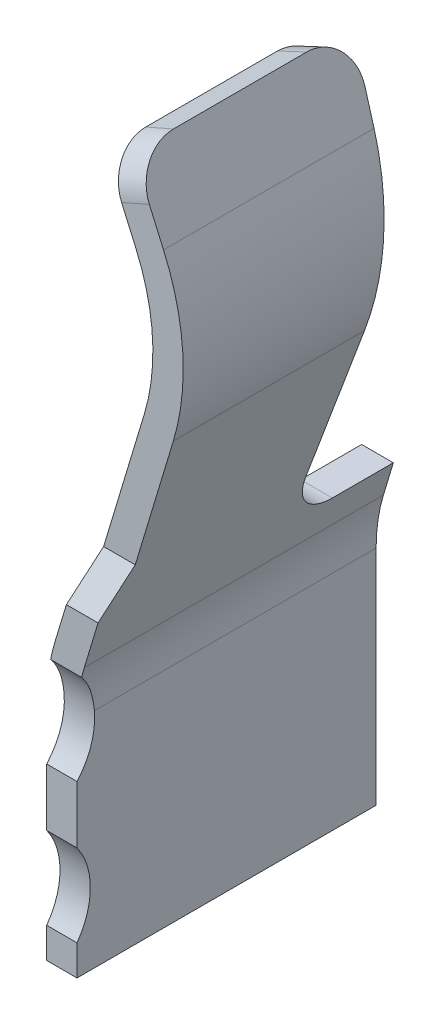
ISO-10303-21;
HEADER;
FILE_DESCRIPTION(('STEP AP214'),'2;1');
FILE_NAME('part.step','',(''),(''),'','','');
FILE_SCHEMA(('AUTOMOTIVE_DESIGN { 1 0 10303 214 1 1 1 1 }'));
ENDSEC;
DATA;
#1=APPLICATION_CONTEXT('core data for automotive mechanical design processes');
#2=APPLICATION_PROTOCOL_DEFINITION('international standard','automotive_design',2000,#1);
#3=PRODUCT_CONTEXT('',#1,'mechanical');
#4=PRODUCT('Part','Part','',(#3));
#5=PRODUCT_RELATED_PRODUCT_CATEGORY('part','',(#4));
#6=PRODUCT_DEFINITION_FORMATION('','',#4);
#7=PRODUCT_DEFINITION_CONTEXT('part definition',#1,'design');
#8=PRODUCT_DEFINITION('design','',#6,#7);
#9=PRODUCT_DEFINITION_SHAPE('','',#8);
#10=(LENGTH_UNIT() NAMED_UNIT(*) SI_UNIT(.MILLI.,.METRE.));
#11=(NAMED_UNIT(*) PLANE_ANGLE_UNIT() SI_UNIT($,.RADIAN.));
#12=(NAMED_UNIT(*) SI_UNIT($,.STERADIAN.) SOLID_ANGLE_UNIT());
#13=UNCERTAINTY_MEASURE_WITH_UNIT(LENGTH_MEASURE(1.E-05),#10,'distance_accuracy_value','');
#14=(GEOMETRIC_REPRESENTATION_CONTEXT(3) GLOBAL_UNCERTAINTY_ASSIGNED_CONTEXT((#13)) GLOBAL_UNIT_ASSIGNED_CONTEXT((#10,
#11,#12)) REPRESENTATION_CONTEXT('',''));
#15=CARTESIAN_POINT('',(0.,0.,0.));
#16=DIRECTION('',(0.,0.,1.));
#17=DIRECTION('',(1.,0.,0.));
#18=AXIS2_PLACEMENT_3D('',#15,#16,#17);
#19=CARTESIAN_POINT('',(3.22386274132999,3.53312166947706,-0.236832722369338));
#20=DIRECTION('',(-0.914255270392898,-0.402239697454473,0.0483789866630426));
#21=DIRECTION('',(0.402711251685503,-0.915327071470027,0.));
#22=AXIS2_PLACEMENT_3D('',#19,#20,#21);
#23=CYLINDRICAL_SURFACE('',#22,0.2);
#24=CARTESIAN_POINT('',(3.21035852267473,3.50329761180303,-0.434687053017797));
#25=CARTESIAN_POINT('',(3.15928159552814,3.6193909515076,-0.448650066039084));
#26=CARTESIAN_POINT('',(3.12101281648182,3.70637250294574,-0.363398989614743));
#27=CARTESIAN_POINT('',(3.12101281648181,3.70637250294574,-0.235652283248446));
#28=(BOUNDED_CURVE() B_SPLINE_CURVE(3,(#24,#25,#26,#27),.UNSPECIFIED.,.F.,
.F.) B_SPLINE_CURVE_WITH_KNOTS((4,4),(3.0320715031167,4.71238898038462),
.UNSPECIFIED.) CURVE() GEOMETRIC_REPRESENTATION_ITEM() RATIONAL_B_SPLINE_CURVE((1.,
0.778229742533871,0.778229742533871,1.)) REPRESENTATION_ITEM(''));
#29=CARTESIAN_POINT('',(3.21035852267473,3.50329761180303,-0.434687053017797));
#30=VERTEX_POINT('',#29);
#31=CARTESIAN_POINT('',(3.12101281648181,3.70637250294574,-0.235652283248446));
#32=VERTEX_POINT('',#31);
#33=EDGE_CURVE('E468',#30,#32,#28,.T.);
#34=ORIENTED_EDGE('',*,*,#33,.F.);
#35=DIRECTION('',(0.914255270392898,0.402239697454473,-0.0483789866630426));
#36=VECTOR('',#35,1.);
#37=CARTESIAN_POINT('',(-20.837177596038,-7.07676024092296,0.837819069551529));
#38=LINE('',#37,#36);
#39=CARTESIAN_POINT('',(3.07305946195422,3.44289092405021,-0.427421697659669));
#40=VERTEX_POINT('',#39);
#41=EDGE_CURVE('E11',#40,#30,#38,.T.);
#42=ORIENTED_EDGE('',*,*,#41,.F.);
#43=CARTESIAN_POINT('',(2.98371375576131,3.64596581519291,-0.228386927890318));
#44=CARTESIAN_POINT('',(2.98371375576131,3.64596581519291,-0.356133634256616));
#45=CARTESIAN_POINT('',(3.02198253480764,3.55898426375477,-0.441384710680957));
#46=CARTESIAN_POINT('',(3.07305946195422,3.44289092405021,-0.427421697659669));
#47=(BOUNDED_CURVE() B_SPLINE_CURVE(3,(#43,#44,#45,#46),.UNSPECIFIED.,.F.,
.F.) B_SPLINE_CURVE_WITH_KNOTS((4,4),(1.57079632679495,3.25111380406287),
.UNSPECIFIED.) CURVE() GEOMETRIC_REPRESENTATION_ITEM() RATIONAL_B_SPLINE_CURVE((1.,
0.778229742533869,0.778229742533869,1.)) REPRESENTATION_ITEM(''));
#48=CARTESIAN_POINT('',(2.98371375576131,3.64596581519291,-0.228386927890318));
#49=VERTEX_POINT('',#48);
#50=EDGE_CURVE('E162',#49,#40,#47,.T.);
#51=ORIENTED_EDGE('',*,*,#50,.F.);
#52=DIRECTION('',(-0.914255270392898,-0.402239697454473,0.0483789866630426));
#53=VECTOR('',#52,1.);
#54=CARTESIAN_POINT('',(3.14332049099289,3.71618708377106,-0.236832722369339));
#55=LINE('',#54,#53);
#56=EDGE_CURVE('E508',#32,#49,#55,.T.);
#57=ORIENTED_EDGE('',*,*,#56,.F.);
#58=EDGE_LOOP('',(#34,#42,#51,#57));
#59=FACE_BOUND('',#58,.T.);
#60=ADVANCED_FACE('F16',(#59),#23,.T.);
#61=CARTESIAN_POINT('',(3.20155506681891,3.52330708865174,0.423604352914838));
#62=DIRECTION('',(0.915327071470027,0.402711251685503,0.));
#63=DIRECTION('',(-0.402711251685503,0.915327071470027,0.));
#64=AXIS2_PLACEMENT_3D('',#61,#62,#63);
#65=CYLINDRICAL_SURFACE('',#64,0.2);
#66=CARTESIAN_POINT('',(3.06425600609841,3.46290040089891,0.423604352914837));
#67=DIRECTION('',(-0.915327071470027,-0.402711251685502,0.));
#68=DIRECTION('',(-0.402711251685502,0.915327071470027,0.));
#69=AXIS2_PLACEMENT_3D('',#66,#67,#68);
#70=CIRCLE('',#69,0.2);
#71=CARTESIAN_POINT('',(3.06425600609841,3.46290040089891,0.623604352914837));
#72=VERTEX_POINT('',#71);
#73=CARTESIAN_POINT('',(2.98371375576131,3.64596581519291,0.423604352914837));
#74=VERTEX_POINT('',#73);
#75=EDGE_CURVE('E175',#72,#74,#70,.T.);
#76=ORIENTED_EDGE('',*,*,#75,.F.);
#77=DIRECTION('',(-0.915327071470027,-0.402711251685503,0.));
#78=VECTOR('',#77,1.);
#79=CARTESIAN_POINT('',(-21.5530633966531,-7.36784176638169,0.623604352914803));
#80=LINE('',#79,#78);
#81=CARTESIAN_POINT('',(3.20155506681891,3.52330708865174,0.623604352914837));
#82=VERTEX_POINT('',#81);
#83=EDGE_CURVE('E27',#82,#72,#80,.T.);
#84=ORIENTED_EDGE('',*,*,#83,.F.);
#85=CARTESIAN_POINT('',(3.20155506681891,3.52330708865174,0.423604352914838));
#86=DIRECTION('',(0.915327071470028,0.4027112516855,0.));
#87=DIRECTION('',(0.4027112516855,-0.915327071470028,0.));
#88=AXIS2_PLACEMENT_3D('',#85,#86,#87);
#89=CIRCLE('',#88,0.2);
#90=CARTESIAN_POINT('',(3.12101281648181,3.70637250294574,0.423604352914837));
#91=VERTEX_POINT('',#90);
#92=EDGE_CURVE('E531',#91,#82,#89,.T.);
#93=ORIENTED_EDGE('',*,*,#92,.F.);
#94=DIRECTION('',(0.915327071470027,0.402711251685503,0.));
#95=VECTOR('',#94,1.);
#96=CARTESIAN_POINT('',(3.12101281648181,3.70637250294574,0.423604352914837));
#97=LINE('',#96,#95);
#98=EDGE_CURVE('E467',#74,#91,#97,.T.);
#99=ORIENTED_EDGE('',*,*,#98,.F.);
#100=EDGE_LOOP('',(#76,#84,#93,#99));
#101=FACE_BOUND('',#100,.T.);
#102=ADVANCED_FACE('F751',(#101),#65,.T.);
#103=CARTESIAN_POINT('',(-25.65,1.65634067151207,-0.212546111318104));
#104=DIRECTION('',(0.,-1.,0.));
#105=DIRECTION('',(0.,0.,-1.));
#106=AXIS2_PLACEMENT_3D('',#103,#104,#105);
#107=PLANE('',#106);
#108=DIRECTION('',(0.,0.,-1.));
#109=VECTOR('',#108,1.);
#110=CARTESIAN_POINT('',(2.88849659089442,1.65634067151207,-0.740000000000021));
#111=LINE('',#110,#109);
#112=CARTESIAN_POINT('',(2.88849659089442,1.65634067151207,-0.438042305987955));
#113=VERTEX_POINT('',#112);
#114=CARTESIAN_POINT('',(2.88849659089442,1.65634067151207,-0.740000000000021));
#115=VERTEX_POINT('',#114);
#116=EDGE_CURVE('E255',#113,#115,#111,.T.);
#117=ORIENTED_EDGE('',*,*,#116,.F.);
#118=DIRECTION('',(1.,0.,0.));
#119=VECTOR('',#118,1.);
#120=CARTESIAN_POINT('',(3.04516492105845,1.65634067151207,-0.438042305987954));
#121=LINE('',#120,#119);
#122=CARTESIAN_POINT('',(3.04516492105846,1.65634067151207,-0.438042305987954));
#123=VERTEX_POINT('',#122);
#124=EDGE_CURVE('E455',#113,#123,#121,.T.);
#125=ORIENTED_EDGE('',*,*,#124,.T.);
#126=DIRECTION('',(0.,0.,1.));
#127=VECTOR('',#126,1.);
#128=CARTESIAN_POINT('',(3.04516492105846,1.65634067151207,-0.74000000000002));
#129=LINE('',#128,#127);
#130=CARTESIAN_POINT('',(3.04516492105846,1.65634067151207,-0.74000000000002));
#131=VERTEX_POINT('',#130);
#132=EDGE_CURVE('E476',#131,#123,#129,.T.);
#133=ORIENTED_EDGE('',*,*,#132,.F.);
#134=DIRECTION('',(-1.,0.,0.));
#135=VECTOR('',#134,1.);
#136=CARTESIAN_POINT('',(3.81,1.65634067151207,-0.740000000000019));
#137=LINE('',#136,#135);
#138=EDGE_CURVE('E496',#131,#115,#137,.T.);
#139=ORIENTED_EDGE('',*,*,#138,.T.);
#140=EDGE_LOOP('',(#117,#125,#133,#139));
#141=FACE_BOUND('',#140,.T.);
#142=ADVANCED_FACE('F314',(#141),#107,.F.);
#143=CARTESIAN_POINT('',(-25.65,3.70637250294571,-0.459111687165995));
#144=DIRECTION('',(0.,0.119413416546905,0.992844618230162));
#145=DIRECTION('',(1.,0.,0.));
#146=AXIS2_PLACEMENT_3D('',#143,#144,#145);
#147=PLANE('',#146);
#148=DIRECTION('',(0.286748539926818,0.951150986717315,-0.11439875574724));
#149=VECTOR('',#148,1.);
#150=CARTESIAN_POINT('',(3.01412236488806,1.55337185451571,-0.200161637444148));
#151=LINE('',#150,#149);
#152=CARTESIAN_POINT('',(3.11266002273041,1.88022335482146,-0.239473382341922));
#153=VERTEX_POINT('',#152);
#154=CARTESIAN_POINT('',(3.32020176045379,2.56864369924933,-0.322272466749581));
#155=VERTEX_POINT('',#154);
#156=EDGE_CURVE('E482',#153,#155,#151,.T.);
#157=ORIENTED_EDGE('',*,*,#156,.F.);
#158=DIRECTION('',(-1.,0.,0.));
#159=VECTOR('',#158,1.);
#160=CARTESIAN_POINT('',(2.88849659089441,1.88022335482146,-0.239473382341922));
#161=LINE('',#160,#159);
#162=CARTESIAN_POINT('',(2.95599169256637,1.88022335482146,-0.239473382341922));
#163=VERTEX_POINT('',#162);
#164=EDGE_CURVE('E380',#153,#163,#161,.T.);
#165=ORIENTED_EDGE('',*,*,#164,.T.);
#166=DIRECTION('',(-0.28674853992682,-0.951150986717314,0.11439875574724));
#167=VECTOR('',#166,1.);
#168=CARTESIAN_POINT('',(2.87033604511149,1.59610175610151,-0.205300934614505));
#169=LINE('',#168,#167);
#170=CARTESIAN_POINT('',(3.17658626409634,2.61194022573825,-0.327479914176623));
#171=VERTEX_POINT('',#170);
#172=EDGE_CURVE('E253',#171,#163,#169,.T.);
#173=ORIENTED_EDGE('',*,*,#172,.F.);
#174=CARTESIAN_POINT('',(3.13447669318341,3.30329498734983,-0.410631932744419));
#175=CARTESIAN_POINT('',(3.2314549897076,3.08287189317973,-0.384120760424612));
#176=CARTESIAN_POINT('',(3.24609551117657,2.84250387207174,-0.355210731501567));
#177=CARTESIAN_POINT('',(3.17658626409634,2.61194022573825,-0.327479914176623));
#178=(BOUNDED_CURVE() B_SPLINE_CURVE(3,(#174,#175,#176,#177),.UNSPECIFIED.,.F.,
.F.) B_SPLINE_CURVE_WITH_KNOTS((4,4),(4.29791199977039,5.00519872138853),
.UNSPECIFIED.) CURVE() GEOMETRIC_REPRESENTATION_ITEM() RATIONAL_B_SPLINE_CURVE((1.,
0.958744787021091,0.958744787021091,1.)) REPRESENTATION_ITEM(''));
#179=CARTESIAN_POINT('',(3.13447669318341,3.30329498734983,-0.410631932744419));
#180=VERTEX_POINT('',#179);
#181=EDGE_CURVE('E504',#180,#171,#178,.T.);
#182=ORIENTED_EDGE('',*,*,#181,.F.);
#183=DIRECTION('',(0.400292818236851,-0.909830186054405,0.109428936813833));
#184=VECTOR('',#183,1.);
#185=CARTESIAN_POINT('',(3.12004918034407,3.33608744850051,-0.414576013974334));
#186=LINE('',#185,#184);
#187=EDGE_CURVE('E251',#40,#180,#186,.T.);
#188=ORIENTED_EDGE('',*,*,#187,.F.);
#189=ORIENTED_EDGE('',*,*,#41,.T.);
#190=DIRECTION('',(-0.40029281823685,0.909830186054405,-0.109428936813833));
#191=VECTOR('',#190,1.);
#192=CARTESIAN_POINT('',(3.25766648991178,3.39577078475993,-0.421754368938235));
#193=LINE('',#192,#191);
#194=CARTESIAN_POINT('',(3.27177575390391,3.36370167510267,-0.417897288102547));
#195=VERTEX_POINT('',#194);
#196=EDGE_CURVE('E514',#195,#30,#193,.T.);
#197=ORIENTED_EDGE('',*,*,#196,.F.);
#198=CARTESIAN_POINT('',(3.32020176045379,2.56864369924933,-0.322272466749581));
#199=CARTESIAN_POINT('',(3.40013739459604,2.83379189253285,-0.354162906673267));
#200=CARTESIAN_POINT('',(3.38330079490673,3.11021511680704,-0.387409439934769));
#201=CARTESIAN_POINT('',(3.27177575390391,3.36370167510267,-0.417897288102547));
#202=(BOUNDED_CURVE() B_SPLINE_CURVE(3,(#198,#199,#200,#201),.UNSPECIFIED.,.F.,
.F.) B_SPLINE_CURVE_WITH_KNOTS((4,4),(1.27798658579106,1.98527330740919),
.UNSPECIFIED.) CURVE() GEOMETRIC_REPRESENTATION_ITEM() RATIONAL_B_SPLINE_CURVE((1.,
0.958744787021091,0.958744787021091,1.)) REPRESENTATION_ITEM(''));
#203=EDGE_CURVE('E493',#155,#195,#202,.T.);
#204=ORIENTED_EDGE('',*,*,#203,.F.);
#205=EDGE_LOOP('',(#157,#165,#173,#182,#188,#189,#197,#204));
#206=FACE_BOUND('',#205,.T.);
#207=ADVANCED_FACE('F310',(#206),#147,.F.);
#208=CARTESIAN_POINT('',(-25.65,1.94413292378283,0.623604352914797));
#209=DIRECTION('',(0.,0.,-1.));
#210=DIRECTION('',(0.,-1.,0.));
#211=AXIS2_PLACEMENT_3D('',#208,#209,#210);
#212=PLANE('',#211);
#213=DIRECTION('',(0.4027112516855,-0.915327071470028,0.));
#214=VECTOR('',#213,1.);
#215=CARTESIAN_POINT('',(3.27177575390391,3.36370167510267,0.623604352914838));
#216=LINE('',#215,#214);
#217=CARTESIAN_POINT('',(3.27177575390391,3.36370167510267,0.623604352914838));
#218=VERTEX_POINT('',#217);
#219=EDGE_CURVE('E524',#82,#218,#216,.T.);
#220=ORIENTED_EDGE('',*,*,#219,.F.);
#221=ORIENTED_EDGE('',*,*,#83,.T.);
#222=DIRECTION('',(-0.402711251685501,0.915327071470028,0.));
#223=VECTOR('',#222,1.);
#224=CARTESIAN_POINT('',(3.13447669318341,3.30329498734984,0.623604352914837));
#225=LINE('',#224,#223);
#226=CARTESIAN_POINT('',(3.13447669318341,3.30329498734983,0.623604352914837));
#227=VERTEX_POINT('',#226);
#228=EDGE_CURVE('E505',#227,#72,#225,.T.);
#229=ORIENTED_EDGE('',*,*,#228,.F.);
#230=CARTESIAN_POINT('',(2.21914962171339,2.90058373566433,0.623604352914836));
#231=DIRECTION('',(0.,0.,1.));
#232=DIRECTION('',(-1.,0.,0.));
#233=AXIS2_PLACEMENT_3D('',#230,#231,#232);
#234=CIRCLE('',#233,1.);
#235=CARTESIAN_POINT('',(3.17658626409634,2.61194022573825,0.623604352914837));
#236=VERTEX_POINT('',#235);
#237=EDGE_CURVE('E256',#236,#227,#234,.T.);
#238=ORIENTED_EDGE('',*,*,#237,.F.);
#239=DIRECTION('',(0.28864350992609,0.957436642382956,0.));
#240=VECTOR('',#239,1.);
#241=CARTESIAN_POINT('',(2.85256335761704,1.53714937485737,0.623604352914836));
#242=LINE('',#241,#240);
#243=CARTESIAN_POINT('',(2.97525884977164,1.94413292378283,0.623604352914837));
#244=VERTEX_POINT('',#243);
#245=EDGE_CURVE('E259',#244,#236,#242,.T.);
#246=ORIENTED_EDGE('',*,*,#245,.F.);
#247=DIRECTION('',(1.,0.,0.));
#248=VECTOR('',#247,1.);
#249=CARTESIAN_POINT('',(-25.65,1.94413292378283,0.623604352914797));
#250=LINE('',#249,#248);
#251=CARTESIAN_POINT('',(3.13192717993567,1.94413292378283,0.623604352914837));
#252=VERTEX_POINT('',#251);
#253=EDGE_CURVE('E499',#244,#252,#250,.T.);
#254=ORIENTED_EDGE('',*,*,#253,.T.);
#255=DIRECTION('',(-0.288643509926088,-0.957436642382956,0.));
#256=VECTOR('',#255,1.);
#257=CARTESIAN_POINT('',(2.99617885397448,1.49385284836845,0.623604352914837));
#258=LINE('',#257,#256);
#259=CARTESIAN_POINT('',(3.32020176045378,2.56864369924933,0.623604352914837));
#260=VERTEX_POINT('',#259);
#261=EDGE_CURVE('E484',#260,#252,#258,.T.);
#262=ORIENTED_EDGE('',*,*,#261,.F.);
#263=CARTESIAN_POINT('',(2.21914962171339,2.90058373566433,0.623604352914836));
#264=DIRECTION('',(0.,0.,-1.));
#265=DIRECTION('',(-1.,0.,0.));
#266=AXIS2_PLACEMENT_3D('',#263,#264,#265);
#267=CIRCLE('',#266,1.15);
#268=EDGE_CURVE('E617',#218,#260,#267,.T.);
#269=ORIENTED_EDGE('',*,*,#268,.F.);
#270=EDGE_LOOP('',(#220,#221,#229,#238,#246,#254,#262,#269));
#271=FACE_BOUND('',#270,.T.);
#272=ADVANCED_FACE('F313',(#271),#212,.F.);
#273=CARTESIAN_POINT('',(-25.65,1.7003498353216,0.749999999999972));
#274=DIRECTION('',(0.,-0.460287319631494,-0.887770005906065));
#275=DIRECTION('',(0.,-0.887770005906065,0.460287319631494));
#276=AXIS2_PLACEMENT_3D('',#273,#274,#275);
#277=PLANE('',#276);
#278=ORIENTED_EDGE('',*,*,#253,.F.);
#279=DIRECTION('',(0.258541028225373,0.857586072334425,-0.444637678635293));
#280=VECTOR('',#279,1.);
#281=CARTESIAN_POINT('',(3.03357656169357,2.13757401070795,0.523309818502746));
#282=LINE('',#281,#280);
#283=CARTESIAN_POINT('',(2.90757891232073,1.7196371362757,0.73999999999998));
#284=VERTEX_POINT('',#283);
#285=EDGE_CURVE('E95',#284,#244,#282,.T.);
#286=ORIENTED_EDGE('',*,*,#285,.F.);
#287=DIRECTION('',(-1.,0.,0.));
#288=VECTOR('',#287,1.);
#289=CARTESIAN_POINT('',(3.81,1.7196371362757,0.739999999999981));
#290=LINE('',#289,#288);
#291=CARTESIAN_POINT('',(3.06424724248477,1.7196371362757,0.73999999999998));
#292=VERTEX_POINT('',#291);
#293=EDGE_CURVE('E589',#292,#284,#290,.T.);
#294=ORIENTED_EDGE('',*,*,#293,.F.);
#295=DIRECTION('',(-0.258541028225372,-0.857586072334425,0.444637678635293));
#296=VECTOR('',#295,1.);
#297=CARTESIAN_POINT('',(3.17977263808379,2.10283732290249,0.541319952677682));
#298=LINE('',#297,#296);
#299=EDGE_CURVE('E83',#252,#292,#298,.T.);
#300=ORIENTED_EDGE('',*,*,#299,.F.);
#301=EDGE_LOOP('',(#278,#286,#294,#300));
#302=FACE_BOUND('',#301,.T.);
#303=ADVANCED_FACE('F327',(#302),#277,.F.);
#304=CARTESIAN_POINT('',(3.81,1.24850586493128,0.739999999999981));
#305=DIRECTION('',(0.,0.,-1.));
#306=DIRECTION('',(0.,-1.,0.));
#307=AXIS2_PLACEMENT_3D('',#304,#305,#306);
#308=PLANE('',#307);
#309=DIRECTION('',(0.,1.,0.));
#310=VECTOR('',#309,1.);
#311=CARTESIAN_POINT('',(2.96,0.145965815192914,0.73999999999998));
#312=LINE('',#311,#310);
#313=CARTESIAN_POINT('',(2.96,0.145965815192914,0.73999999999998));
#314=VERTEX_POINT('',#313);
#315=CARTESIAN_POINT('',(2.96,0.296740599868486,0.73999999999998));
#316=VERTEX_POINT('',#315);
#317=EDGE_CURVE('E421',#314,#316,#312,.T.);
#318=ORIENTED_EDGE('',*,*,#317,.T.);
#319=DIRECTION('',(-1.,0.,0.));
#320=VECTOR('',#319,1.);
#321=CARTESIAN_POINT('',(-25.65,0.296740599868486,0.73999999999994));
#322=LINE('',#321,#320);
#323=CARTESIAN_POINT('',(2.81,0.296740599868486,0.739999999999979));
#324=VERTEX_POINT('',#323);
#325=EDGE_CURVE('E237',#316,#324,#322,.T.);
#326=ORIENTED_EDGE('',*,*,#325,.T.);
#327=DIRECTION('',(0.,-1.,0.));
#328=VECTOR('',#327,1.);
#329=CARTESIAN_POINT('',(2.81,0.145965815192914,0.739999999999979));
#330=LINE('',#329,#328);
#331=CARTESIAN_POINT('',(2.81,0.145965815192914,0.739999999999979));
#332=VERTEX_POINT('',#331);
#333=EDGE_CURVE('E234',#324,#332,#330,.T.);
#334=ORIENTED_EDGE('',*,*,#333,.T.);
#335=DIRECTION('',(1.,0.,0.));
#336=VECTOR('',#335,1.);
#337=CARTESIAN_POINT('',(2.96,0.145965815192914,0.73999999999998));
#338=LINE('',#337,#336);
#339=EDGE_CURVE('E219',#332,#314,#338,.T.);
#340=ORIENTED_EDGE('',*,*,#339,.T.);
#341=EDGE_LOOP('',(#318,#326,#334,#340));
#342=FACE_BOUND('',#341,.T.);
#343=ADVANCED_FACE('F770',(#342),#308,.F.);
#344=CARTESIAN_POINT('',(3.81,1.24850586493128,-0.740000000000019));
#345=DIRECTION('',(0.,0.,-1.));
#346=DIRECTION('',(0.,-1.,0.));
#347=AXIS2_PLACEMENT_3D('',#344,#345,#346);
#348=PLANE('',#347);
#349=ORIENTED_EDGE('',*,*,#138,.F.);
#350=DIRECTION('',(0.288643509926088,0.957436642382956,0.));
#351=VECTOR('',#350,1.);
#352=CARTESIAN_POINT('',(2.99617885397448,1.49385284836845,-0.74000000000002));
#353=LINE('',#352,#351);
#354=CARTESIAN_POINT('',(2.99617885397448,1.49385284836845,-0.74000000000002));
#355=VERTEX_POINT('',#354);
#356=EDGE_CURVE('E483',#355,#131,#353,.T.);
#357=ORIENTED_EDGE('',*,*,#356,.F.);
#358=CARTESIAN_POINT('',(3.81,1.24850586493128,-0.740000000000019));
#359=DIRECTION('',(0.,0.,-1.));
#360=DIRECTION('',(1.,0.,0.));
#361=AXIS2_PLACEMENT_3D('',#358,#359,#360);
#362=CIRCLE('',#361,0.85);
#363=CARTESIAN_POINT('',(2.96,1.24850586493128,-0.74000000000002));
#364=VERTEX_POINT('',#363);
#365=EDGE_CURVE('E449',#364,#355,#362,.T.);
#366=ORIENTED_EDGE('',*,*,#365,.F.);
#367=DIRECTION('',(0.,1.,0.));
#368=VECTOR('',#367,1.);
#369=CARTESIAN_POINT('',(2.96,0.145965815192914,-0.74000000000002));
#370=LINE('',#369,#368);
#371=CARTESIAN_POINT('',(2.96,0.145965815192914,-0.74000000000002));
#372=VERTEX_POINT('',#371);
#373=EDGE_CURVE('E430',#372,#364,#370,.T.);
#374=ORIENTED_EDGE('',*,*,#373,.F.);
#375=DIRECTION('',(1.,0.,0.));
#376=VECTOR('',#375,1.);
#377=CARTESIAN_POINT('',(2.96,0.145965815192914,-0.74000000000002));
#378=LINE('',#377,#376);
#379=CARTESIAN_POINT('',(2.81,0.145965815192914,-0.740000000000021));
#380=VERTEX_POINT('',#379);
#381=EDGE_CURVE('E434',#380,#372,#378,.T.);
#382=ORIENTED_EDGE('',*,*,#381,.F.);
#383=DIRECTION('',(0.,-1.,0.));
#384=VECTOR('',#383,1.);
#385=CARTESIAN_POINT('',(2.81,0.145965815192914,-0.740000000000021));
#386=LINE('',#385,#384);
#387=CARTESIAN_POINT('',(2.81,1.24850586493128,-0.740000000000021));
#388=VERTEX_POINT('',#387);
#389=EDGE_CURVE('E42',#388,#380,#386,.T.);
#390=ORIENTED_EDGE('',*,*,#389,.F.);
#391=CARTESIAN_POINT('',(3.81,1.24850586493128,-0.740000000000019));
#392=DIRECTION('',(0.,0.,1.));
#393=DIRECTION('',(1.,0.,0.));
#394=AXIS2_PLACEMENT_3D('',#391,#392,#393);
#395=CIRCLE('',#394,1.);
#396=CARTESIAN_POINT('',(2.85256335761705,1.53714937485737,-0.740000000000021));
#397=VERTEX_POINT('',#396);
#398=EDGE_CURVE('E374',#397,#388,#395,.T.);
#399=ORIENTED_EDGE('',*,*,#398,.F.);
#400=DIRECTION('',(-0.28864350992609,-0.957436642382956,0.));
#401=VECTOR('',#400,1.);
#402=CARTESIAN_POINT('',(2.85256335761705,1.53714937485737,-0.740000000000021));
#403=LINE('',#402,#401);
#404=EDGE_CURVE('E462',#115,#397,#403,.T.);
#405=ORIENTED_EDGE('',*,*,#404,.F.);
#406=EDGE_LOOP('',(#349,#357,#366,#374,#382,#390,#399,#405));
#407=FACE_BOUND('',#406,.T.);
#408=ADVANCED_FACE('F309',(#407),#348,.T.);
#409=CARTESIAN_POINT('',(2.81,0.145965815192914,-0.740000000000021));
#410=DIRECTION('',(1.,0.,0.));
#411=DIRECTION('',(0.,1.,0.));
#412=AXIS2_PLACEMENT_3D('',#409,#410,#411);
#413=PLANE('',#412);
#414=DIRECTION('',(0.,-1.,0.));
#415=VECTOR('',#414,1.);
#416=CARTESIAN_POINT('',(2.81,0.145965815192914,0.739999999999979));
#417=LINE('',#416,#415);
#418=CARTESIAN_POINT('',(2.81,0.988055123608201,0.739999999999979));
#419=VERTEX_POINT('',#418);
#420=CARTESIAN_POINT('',(2.81,0.703259400131467,0.739999999999979));
#421=VERTEX_POINT('',#420);
#422=EDGE_CURVE('E206',#419,#421,#417,.T.);
#423=ORIENTED_EDGE('',*,*,#422,.F.);
#424=CARTESIAN_POINT('',(2.81,1.21669179396546,0.995153761033096));
#425=DIRECTION('',(1.,0.,0.));
#426=DIRECTION('',(0.,1.,0.));
#427=AXIS2_PLACEMENT_3D('',#424,#425,#426);
#428=CIRCLE('',#427,0.342604974863759);
#429=CARTESIAN_POINT('',(2.81,1.24850586493128,0.654029100989324));
#430=VERTEX_POINT('',#429);
#431=EDGE_CURVE('E377',#419,#430,#428,.T.);
#432=ORIENTED_EDGE('',*,*,#431,.T.);
#433=DIRECTION('',(0.,0.,1.));
#434=VECTOR('',#433,1.);
#435=CARTESIAN_POINT('',(2.81,1.24850586493128,-0.740000000000021));
#436=LINE('',#435,#434);
#437=EDGE_CURVE('E366',#388,#430,#436,.T.);
#438=ORIENTED_EDGE('',*,*,#437,.F.);
#439=ORIENTED_EDGE('',*,*,#389,.T.);
#440=DIRECTION('',(0.,0.,1.));
#441=VECTOR('',#440,1.);
#442=CARTESIAN_POINT('',(2.81,0.145965815192914,-0.740000000000021));
#443=LINE('',#442,#441);
#444=EDGE_CURVE('E445',#380,#332,#443,.T.);
#445=ORIENTED_EDGE('',*,*,#444,.T.);
#446=ORIENTED_EDGE('',*,*,#333,.F.);
#447=CARTESIAN_POINT('',(2.81,0.499999999999977,1.0194268345702));
#448=DIRECTION('',(1.,0.,0.));
#449=DIRECTION('',(0.,1.,0.));
#450=AXIS2_PLACEMENT_3D('',#447,#448,#449);
#451=CIRCLE('',#450,0.345533991988848);
#452=EDGE_CURVE('E226',#324,#421,#451,.T.);
#453=ORIENTED_EDGE('',*,*,#452,.T.);
#454=EDGE_LOOP('',(#423,#432,#438,#439,#445,#446,#453));
#455=FACE_BOUND('',#454,.T.);
#456=ADVANCED_FACE('F232',(#455),#413,.F.);
#457=CARTESIAN_POINT('',(3.81,1.24850586493128,-0.740000000000019));
#458=DIRECTION('',(0.,0.,1.));
#459=DIRECTION('',(-1.,0.,0.));
#460=AXIS2_PLACEMENT_3D('',#457,#458,#459);
#461=CYLINDRICAL_SURFACE('',#460,1.);
#462=ORIENTED_EDGE('',*,*,#437,.T.);
#463=CARTESIAN_POINT('',(2.81,1.24850586493127,0.654029100989324));
#464=CARTESIAN_POINT('',(2.80999992592637,1.25306932177748,0.654454497923835));
#465=CARTESIAN_POINT('',(2.81003123527863,1.25762446546712,0.654969794425774));
#466=CARTESIAN_POINT('',(2.81015516509568,1.26669234380872,0.656178662703507));
#467=CARTESIAN_POINT('',(2.81024754920297,1.27120517419842,0.656871540938563));
#468=CARTESIAN_POINT('',(2.81049191329322,1.28018764830056,0.658435530000101));
#469=CARTESIAN_POINT('',(2.81064375710387,1.28465736694881,0.659306231418194));
#470=CARTESIAN_POINT('',(2.81100522296896,1.29355289226453,0.661225514697385));
#471=CARTESIAN_POINT('',(2.81121480554091,1.29797872680563,0.66227397481712));
#472=CARTESIAN_POINT('',(2.81168997207293,1.30678583476397,0.664548502475786));
#473=CARTESIAN_POINT('',(2.81195560747397,1.31116706334694,0.665774732832754));
#474=CARTESIAN_POINT('',(2.81254110847119,1.31988437499395,0.668404514864849));
#475=CARTESIAN_POINT('',(2.81286110900543,1.32422031651338,0.669808505488944));
#476=CARTESIAN_POINT('',(2.81355358930377,1.33284654509273,0.672793524574298));
#477=CARTESIAN_POINT('',(2.81392627862693,1.33713657245114,0.67437525453736));
#478=CARTESIAN_POINT('',(2.81472239758146,1.34567049059148,0.677715533217567));
#479=CARTESIAN_POINT('',(2.81514610132699,1.34991398511754,0.679475028174295));
#480=CARTESIAN_POINT('',(2.81603678150611,1.35830019523904,0.683146652073494));
#481=CARTESIAN_POINT('',(2.81650349280442,1.36244335249443,0.685057836907499));
#482=CARTESIAN_POINT('',(2.81747687139799,1.37063194178074,0.6890335315101));
#483=CARTESIAN_POINT('',(2.81798338788338,1.3746776733665,0.691097460992356));
#484=CARTESIAN_POINT('',(2.81903286831764,1.38267128376232,0.695378434355305));
#485=CARTESIAN_POINT('',(2.81957575264737,1.3866193519919,0.69759514404689));
#486=CARTESIAN_POINT('',(2.82069455701777,1.39441764648526,0.702181418874191));
#487=CARTESIAN_POINT('',(2.82127045700561,1.39826793013232,0.704550891332612));
#488=CARTESIAN_POINT('',(2.82245197037195,1.40587073759695,0.709442454924467));
#489=CARTESIAN_POINT('',(2.82305761081716,1.40962316741917,0.711964685588729));
#490=CARTESIAN_POINT('',(2.82429537926365,1.4170304504751,0.717161525963165));
#491=CARTESIAN_POINT('',(2.82492756852699,1.42068504210779,0.719836493879691));
#492=CARTESIAN_POINT('',(2.82621529345779,1.42789683764576,0.725338623347788));
#493=CARTESIAN_POINT('',(2.82687091152925,1.43145359950846,0.728166344681211));
#494=CARTESIAN_POINT('',(2.82820248405423,1.43847023752972,0.733973670299352));
#495=CARTESIAN_POINT('',(2.82887852949904,1.44192948379825,0.736954014976151));
#496=CARTESIAN_POINT('',(2.82956088186527,1.44532846432271,0.73999999999998));
#497=B_SPLINE_CURVE_WITH_KNOTS('',3,(#463,#464,#465,#466,#467,#468,#469,#470,#471,#472,#473,
#474,#475,#476,#477,#478,#479,#480,#481,#482,#483,#484,#485,#486,#487,#488,#489,#490,#491,#492,
#493,#494,#495,#496),.UNSPECIFIED.,.F.,.F.,(4,2,2,2,2,2,2,2,2,2,2,2,2,2,2,2,4),(0.,
0.013748827736232,0.0274447569667543,0.0411095020469267,0.0547649260984996,0.0684329369744623,
0.0821353821572885,0.0958939450956067,0.109730045405059,0.123485924962941,0.137191991355335,
0.150868974599205,0.164537737053089,0.17821917870054,0.191934141578145,0.205703315519925,
0.219547147320743),.UNSPECIFIED.);
#498=CARTESIAN_POINT('',(2.82956088186527,1.44532846432271,0.739999999999979));
#499=VERTEX_POINT('',#498);
#500=EDGE_CURVE('E238',#430,#499,#497,.T.);
#501=ORIENTED_EDGE('',*,*,#500,.T.);
#502=CARTESIAN_POINT('',(3.81,1.24850586493128,0.739999999999981));
#503=DIRECTION('',(0.,0.,1.));
#504=DIRECTION('',(1.,0.,0.));
#505=AXIS2_PLACEMENT_3D('',#502,#503,#504);
#506=CIRCLE('',#505,1.);
#507=CARTESIAN_POINT('',(2.85256335761705,1.53714937485737,0.739999999999979));
#508=VERTEX_POINT('',#507);
#509=EDGE_CURVE('E383',#508,#499,#506,.T.);
#510=ORIENTED_EDGE('',*,*,#509,.F.);
#511=DIRECTION('',(0.,0.,1.));
#512=VECTOR('',#511,1.);
#513=CARTESIAN_POINT('',(2.85256335761705,1.53714937485737,-0.740000000000021));
#514=LINE('',#513,#512);
#515=EDGE_CURVE('E260',#397,#508,#514,.T.);
#516=ORIENTED_EDGE('',*,*,#515,.F.);
#517=ORIENTED_EDGE('',*,*,#398,.T.);
#518=EDGE_LOOP('',(#462,#501,#510,#516,#517));
#519=FACE_BOUND('',#518,.T.);
#520=ADVANCED_FACE('F282',(#519),#461,.T.);
#521=CARTESIAN_POINT('',(2.85256335761705,1.53714937485737,-0.740000000000021));
#522=DIRECTION('',(0.957436642382956,-0.28864350992609,0.));
#523=DIRECTION('',(0.,0.,-1.));
#524=AXIS2_PLACEMENT_3D('',#521,#522,#523);
#525=PLANE('',#524);
#526=ORIENTED_EDGE('',*,*,#172,.T.);
#527=CARTESIAN_POINT('',(2.95599169256637,1.88022335482146,-0.239473382341922));
#528=CARTESIAN_POINT('',(2.95360172570135,1.87229578405696,-0.238519901512672));
#529=CARTESIAN_POINT('',(2.95119884441548,1.86432537588468,-0.238042305987954));
#530=CARTESIAN_POINT('',(2.94879165317817,1.85634067151208,-0.238042305987954));
#531=(BOUNDED_CURVE() B_SPLINE_CURVE(3,(#527,#528,#529,#530),.UNSPECIFIED.,.F.,
.F.) B_SPLINE_CURVE_WITH_KNOTS((4,4),(4.59268992994791,4.71238898038469),
.UNSPECIFIED.) CURVE() GEOMETRIC_REPRESENTATION_ITEM() RATIONAL_B_SPLINE_CURVE((1.,
0.998806367803328,0.998806367803328,1.)) REPRESENTATION_ITEM(''));
#532=CARTESIAN_POINT('',(2.94879165317817,1.85634067151208,-0.238042305987954));
#533=VERTEX_POINT('',#532);
#534=EDGE_CURVE('E469',#163,#533,#531,.T.);
#535=ORIENTED_EDGE('',*,*,#534,.T.);
#536=CARTESIAN_POINT('',(2.94879165317817,1.85634067151208,-0.238042305987954));
#537=CARTESIAN_POINT('',(2.91347162343648,1.73918338398669,-0.238042305987954));
#538=CARTESIAN_POINT('',(2.88849659089442,1.65634067151208,-0.320885018462573));
#539=CARTESIAN_POINT('',(2.88849659089442,1.65634067151207,-0.438042305987955));
#540=(BOUNDED_CURVE() B_SPLINE_CURVE(3,(#536,#537,#538,#539),.UNSPECIFIED.,.F.,
.F.) B_SPLINE_CURVE_WITH_KNOTS((4,4),(4.71238898038469,6.28318530717959),
.UNSPECIFIED.) CURVE() GEOMETRIC_REPRESENTATION_ITEM() RATIONAL_B_SPLINE_CURVE((1.,
0.804737854124365,0.804737854124365,1.)) REPRESENTATION_ITEM(''));
#541=EDGE_CURVE('E475',#533,#113,#540,.T.);
#542=ORIENTED_EDGE('',*,*,#541,.T.);
#543=ORIENTED_EDGE('',*,*,#116,.T.);
#544=ORIENTED_EDGE('',*,*,#404,.T.);
#545=ORIENTED_EDGE('',*,*,#515,.T.);
#546=DIRECTION('',(-0.28864350992609,-0.957436642382956,0.));
#547=VECTOR('',#546,1.);
#548=CARTESIAN_POINT('',(2.85256335761704,1.53714937485737,0.739999999999979));
#549=LINE('',#548,#547);
#550=EDGE_CURVE('E387',#284,#508,#549,.T.);
#551=ORIENTED_EDGE('',*,*,#550,.F.);
#552=ORIENTED_EDGE('',*,*,#285,.T.);
#553=ORIENTED_EDGE('',*,*,#245,.T.);
#554=DIRECTION('',(0.,0.,1.));
#555=VECTOR('',#554,1.);
#556=CARTESIAN_POINT('',(3.17658626409634,2.61194022573825,-0.74000000000002));
#557=LINE('',#556,#555);
#558=EDGE_CURVE('E523',#171,#236,#557,.T.);
#559=ORIENTED_EDGE('',*,*,#558,.F.);
#560=EDGE_LOOP('',(#526,#535,#542,#543,#544,#545,#551,#552,#553,#559));
#561=FACE_BOUND('',#560,.T.);
#562=ADVANCED_FACE('F18',(#561),#525,.F.);
#563=CARTESIAN_POINT('',(2.21914962171339,2.90058373566433,-0.740000000000021));
#564=DIRECTION('',(0.,0.,1.));
#565=DIRECTION('',(-1.,0.,0.));
#566=AXIS2_PLACEMENT_3D('',#563,#564,#565);
#567=CYLINDRICAL_SURFACE('',#566,1.);
#568=DIRECTION('',(0.,0.,1.));
#569=VECTOR('',#568,1.);
#570=CARTESIAN_POINT('',(3.13447669318341,3.30329498734983,-0.74000000000002));
#571=LINE('',#570,#569);
#572=EDGE_CURVE('E500',#180,#227,#571,.T.);
#573=ORIENTED_EDGE('',*,*,#572,.F.);
#574=ORIENTED_EDGE('',*,*,#181,.T.);
#575=ORIENTED_EDGE('',*,*,#558,.T.);
#576=ORIENTED_EDGE('',*,*,#237,.T.);
#577=EDGE_LOOP('',(#573,#574,#575,#576));
#578=FACE_BOUND('',#577,.T.);
#579=ADVANCED_FACE('F298',(#578),#567,.F.);
#580=CARTESIAN_POINT('',(3.13447669318341,3.30329498734984,-0.74000000000002));
#581=DIRECTION('',(0.915327071470028,0.402711251685501,0.));
#582=DIRECTION('',(0.,0.,-1.));
#583=AXIS2_PLACEMENT_3D('',#580,#581,#582);
#584=PLANE('',#583);
#585=ORIENTED_EDGE('',*,*,#228,.T.);
#586=ORIENTED_EDGE('',*,*,#75,.T.);
#587=DIRECTION('',(0.,0.,1.));
#588=VECTOR('',#587,1.);
#589=CARTESIAN_POINT('',(2.98371375576131,3.64596581519291,-0.740000000000021));
#590=LINE('',#589,#588);
#591=EDGE_CURVE('E463',#49,#74,#590,.T.);
#592=ORIENTED_EDGE('',*,*,#591,.F.);
#593=ORIENTED_EDGE('',*,*,#50,.T.);
#594=ORIENTED_EDGE('',*,*,#187,.T.);
#595=ORIENTED_EDGE('',*,*,#572,.T.);
#596=EDGE_LOOP('',(#585,#586,#592,#593,#594,#595));
#597=FACE_BOUND('',#596,.T.);
#598=ADVANCED_FACE('F294',(#597),#584,.F.);
#599=CARTESIAN_POINT('',(3.12101281648181,3.70637250294574,-0.74000000000002));
#600=DIRECTION('',(0.402711251685503,-0.915327071470027,0.));
#601=DIRECTION('',(0.,0.,-1.));
#602=AXIS2_PLACEMENT_3D('',#599,#600,#601);
#603=PLANE('',#602);
#604=ORIENTED_EDGE('',*,*,#591,.T.);
#605=ORIENTED_EDGE('',*,*,#98,.T.);
#606=DIRECTION('',(0.,0.,1.));
#607=VECTOR('',#606,1.);
#608=CARTESIAN_POINT('',(3.12101281648181,3.70637250294574,-0.74000000000002));
#609=LINE('',#608,#607);
#610=EDGE_CURVE('E535',#32,#91,#609,.T.);
#611=ORIENTED_EDGE('',*,*,#610,.F.);
#612=ORIENTED_EDGE('',*,*,#56,.T.);
#613=EDGE_LOOP('',(#604,#605,#611,#612));
#614=FACE_BOUND('',#613,.T.);
#615=ADVANCED_FACE('F297',(#614),#603,.F.);
#616=CARTESIAN_POINT('',(3.27177575390392,3.36370167510267,-0.74000000000002));
#617=DIRECTION('',(-0.915327071470028,-0.4027112516855,0.));
#618=DIRECTION('',(-0.4027112516855,0.915327071470028,0.));
#619=AXIS2_PLACEMENT_3D('',#616,#617,#618);
#620=PLANE('',#619);
#621=ORIENTED_EDGE('',*,*,#610,.T.);
#622=ORIENTED_EDGE('',*,*,#92,.T.);
#623=ORIENTED_EDGE('',*,*,#219,.T.);
#624=DIRECTION('',(0.,0.,1.));
#625=VECTOR('',#624,1.);
#626=CARTESIAN_POINT('',(3.27177575390392,3.36370167510267,-0.74000000000002));
#627=LINE('',#626,#625);
#628=EDGE_CURVE('E603',#195,#218,#627,.T.);
#629=ORIENTED_EDGE('',*,*,#628,.F.);
#630=ORIENTED_EDGE('',*,*,#196,.T.);
#631=ORIENTED_EDGE('',*,*,#33,.T.);
#632=EDGE_LOOP('',(#621,#622,#623,#629,#630,#631));
#633=FACE_BOUND('',#632,.T.);
#634=ADVANCED_FACE('F320',(#633),#620,.F.);
#635=CARTESIAN_POINT('',(2.21914962171339,2.90058373566433,-0.740000000000021));
#636=DIRECTION('',(0.,0.,1.));
#637=DIRECTION('',(-1.,0.,0.));
#638=AXIS2_PLACEMENT_3D('',#635,#636,#637);
#639=CYLINDRICAL_SURFACE('',#638,1.15);
#640=DIRECTION('',(0.,0.,1.));
#641=VECTOR('',#640,1.);
#642=CARTESIAN_POINT('',(3.32020176045379,2.56864369924933,-0.74000000000002));
#643=LINE('',#642,#641);
#644=EDGE_CURVE('E487',#155,#260,#643,.T.);
#645=ORIENTED_EDGE('',*,*,#644,.F.);
#646=ORIENTED_EDGE('',*,*,#203,.T.);
#647=ORIENTED_EDGE('',*,*,#628,.T.);
#648=ORIENTED_EDGE('',*,*,#268,.T.);
#649=EDGE_LOOP('',(#645,#646,#647,#648));
#650=FACE_BOUND('',#649,.T.);
#651=ADVANCED_FACE('F316',(#650),#639,.T.);
#652=CARTESIAN_POINT('',(2.99617885397448,1.49385284836845,-0.74000000000002));
#653=DIRECTION('',(-0.957436642382956,0.288643509926088,0.));
#654=DIRECTION('',(0.,0.,1.));
#655=AXIS2_PLACEMENT_3D('',#652,#653,#654);
#656=PLANE('',#655);
#657=ORIENTED_EDGE('',*,*,#356,.T.);
#658=ORIENTED_EDGE('',*,*,#132,.T.);
#659=CARTESIAN_POINT('',(3.04516492105846,1.65634067151207,-0.438042305987954));
#660=CARTESIAN_POINT('',(3.04516492105846,1.65634067151208,-0.320885018462573));
#661=CARTESIAN_POINT('',(3.07013995360051,1.73918338398669,-0.238042305987954));
#662=CARTESIAN_POINT('',(3.1054599833422,1.85634067151208,-0.238042305987954));
#663=(BOUNDED_CURVE() B_SPLINE_CURVE(3,(#659,#660,#661,#662),.UNSPECIFIED.,.F.,
.F.) B_SPLINE_CURVE_WITH_KNOTS((4,4),(0.,1.5707963267949),
.UNSPECIFIED.) CURVE() GEOMETRIC_REPRESENTATION_ITEM() RATIONAL_B_SPLINE_CURVE((1.,
0.804737854124365,0.804737854124365,1.)) REPRESENTATION_ITEM(''));
#664=CARTESIAN_POINT('',(3.1054599833422,1.85634067151208,-0.238042305987954));
#665=VERTEX_POINT('',#664);
#666=EDGE_CURVE('E267',#123,#665,#663,.T.);
#667=ORIENTED_EDGE('',*,*,#666,.T.);
#668=CARTESIAN_POINT('',(3.1054599833422,1.85634067151208,-0.238042305987954));
#669=CARTESIAN_POINT('',(3.10786717457951,1.86432537588468,-0.238042305987954));
#670=CARTESIAN_POINT('',(3.11027005586539,1.87229578405696,-0.238519901512672));
#671=CARTESIAN_POINT('',(3.11266002273041,1.88022335482146,-0.239473382341922));
#672=(BOUNDED_CURVE() B_SPLINE_CURVE(3,(#668,#669,#670,#671),.UNSPECIFIED.,.F.,
.F.) B_SPLINE_CURVE_WITH_KNOTS((4,4),(1.5707963267949,1.69049537723168),
.UNSPECIFIED.) CURVE() GEOMETRIC_REPRESENTATION_ITEM() RATIONAL_B_SPLINE_CURVE((1.,
0.998806367803328,0.998806367803328,1.)) REPRESENTATION_ITEM(''));
#673=EDGE_CURVE('E261',#665,#153,#672,.T.);
#674=ORIENTED_EDGE('',*,*,#673,.T.);
#675=ORIENTED_EDGE('',*,*,#156,.T.);
#676=ORIENTED_EDGE('',*,*,#644,.T.);
#677=ORIENTED_EDGE('',*,*,#261,.T.);
#678=ORIENTED_EDGE('',*,*,#299,.T.);
#679=DIRECTION('',(0.288643509926088,0.957436642382956,0.));
#680=VECTOR('',#679,1.);
#681=CARTESIAN_POINT('',(2.99617885397448,1.49385284836845,0.73999999999998));
#682=LINE('',#681,#680);
#683=CARTESIAN_POINT('',(2.99617885397448,1.49385284836845,0.73999999999998));
#684=VERTEX_POINT('',#683);
#685=EDGE_CURVE('E230',#684,#292,#682,.T.);
#686=ORIENTED_EDGE('',*,*,#685,.F.);
#687=DIRECTION('',(0.,0.,1.));
#688=VECTOR('',#687,1.);
#689=CARTESIAN_POINT('',(2.99617885397448,1.49385284836845,-0.74000000000002));
#690=LINE('',#689,#688);
#691=EDGE_CURVE('E572',#355,#684,#690,.T.);
#692=ORIENTED_EDGE('',*,*,#691,.F.);
#693=EDGE_LOOP('',(#657,#658,#667,#674,#675,#676,#677,#678,#686,#692));
#694=FACE_BOUND('',#693,.T.);
#695=ADVANCED_FACE('F319',(#694),#656,.F.);
#696=CARTESIAN_POINT('',(3.81,1.24850586493128,-0.740000000000019));
#697=DIRECTION('',(0.,0.,1.));
#698=DIRECTION('',(-1.,0.,0.));
#699=AXIS2_PLACEMENT_3D('',#696,#697,#698);
#700=CYLINDRICAL_SURFACE('',#699,0.85);
#701=CARTESIAN_POINT('',(3.81,1.24850586493128,0.739999999999981));
#702=DIRECTION('',(0.,0.,-1.));
#703=DIRECTION('',(1.,0.,0.));
#704=AXIS2_PLACEMENT_3D('',#701,#702,#703);
#705=CIRCLE('',#704,0.85);
#706=CARTESIAN_POINT('',(2.9831016601971,1.44532846432271,0.73999999999998));
#707=VERTEX_POINT('',#706);
#708=EDGE_CURVE('E349',#707,#684,#705,.T.);
#709=ORIENTED_EDGE('',*,*,#708,.F.);
#710=CARTESIAN_POINT('',(2.98310166019709,1.44532846432271,0.73999999999998));
#711=CARTESIAN_POINT('',(2.98229373596084,1.44193422770695,0.736958271493098));
#712=CARTESIAN_POINT('',(2.98149353088792,1.43847955797059,0.733981716742319));
#713=CARTESIAN_POINT('',(2.97991797456415,1.43147212175971,0.728181521053011));
#714=CARTESIAN_POINT('',(2.97914250954499,1.42792001022663,0.725357119538411));
#715=CARTESIAN_POINT('',(2.97761989827603,1.4207175323937,0.719861180213829));
#716=CARTESIAN_POINT('',(2.97687264755814,1.41706763678396,0.71718905488421));
#717=CARTESIAN_POINT('',(2.97541005336383,1.40966975247532,0.711997459324748));
#718=CARTESIAN_POINT('',(2.97469462892649,1.40592205633012,0.70947759512215));
#719=CARTESIAN_POINT('',(2.97329934250923,1.39832873431199,0.704590332990138));
#720=CARTESIAN_POINT('',(2.97261943791235,1.39448323442784,0.702222751523349));
#721=CARTESIAN_POINT('',(2.97129892755124,1.38669456373035,0.697639830714333));
#722=CARTESIAN_POINT('',(2.97065833224803,1.38275136730644,0.695424531879018));
#723=CARTESIAN_POINT('',(2.96942024874446,1.37476761007239,0.691145978302787));
#724=CARTESIAN_POINT('',(2.96882283833137,1.37072689023599,0.689082997790646));
#725=CARTESIAN_POINT('',(2.96767502089455,1.36254855284234,0.685108739352284));
#726=CARTESIAN_POINT('',(2.96712477236529,1.35841066384869,0.683197974378515));
#727=CARTESIAN_POINT('',(2.96607356129916,1.35002514120476,0.679522568881539));
#728=CARTESIAN_POINT('',(2.96557301819717,1.34577690210598,0.677759189022487));
#729=CARTESIAN_POINT('',(2.96463270107624,1.33723291777967,0.674411725036891));
#730=CARTESIAN_POINT('',(2.96419258568452,1.33293760118074,0.672826643700267));
#731=CARTESIAN_POINT('',(2.96337498861422,1.32430048357208,0.669835440034503));
#732=CARTESIAN_POINT('',(2.96299724035231,1.31995896955667,0.668428562333123));
#733=CARTESIAN_POINT('',(2.9623062239364,1.31123044848471,0.665793545957981));
#734=CARTESIAN_POINT('',(2.96199277597818,1.3068436053387,0.664564911759195));
#735=CARTESIAN_POINT('',(2.96143220587039,1.29802547391543,0.662286113687467));
#736=CARTESIAN_POINT('',(2.96118500128929,1.29359424806089,0.661235728608814));
#737=CARTESIAN_POINT('',(2.96075874723657,1.28468842884806,0.65931313537944));
#738=CARTESIAN_POINT('',(2.96057972162783,1.28021382086674,0.658440989662554));
#739=CARTESIAN_POINT('',(2.96029168407829,1.27122235283852,0.656874652664155));
#740=CARTESIAN_POINT('',(2.96018280925909,1.26670542744488,0.656180811490092));
#741=CARTESIAN_POINT('',(2.96003679588108,1.25763046365139,0.654970556104551));
#742=CARTESIAN_POINT('',(2.95999991204074,1.25307233639069,0.654454777190054));
#743=CARTESIAN_POINT('',(2.96,1.24850586493127,0.654029100989324));
#744=B_SPLINE_CURVE_WITH_KNOTS('',3,(#710,#711,#712,#713,#714,#715,#716,#717,#718,#719,#720,
#721,#722,#723,#724,#725,#726,#727,#728,#729,#730,#731,#732,#733,#734,#735,#736,#737,#738,#739,
#740,#741,#742,#743),.UNSPECIFIED.,.F.,.F.,(4,2,2,2,2,2,2,2,2,2,2,2,2,2,2,2,4),(0.,
0.0138857173785058,0.0276939528951883,0.0414446944234779,0.0551581812157602,0.0688548176549654,
0.0825550833892894,0.0962794417966586,0.110048248811198,0.123924815747354,0.137719445398476,
0.151453492382398,0.165148594715206,0.178826575238555,0.192509338715511,0.206218766980375,
0.219976614634782),.UNSPECIFIED.);
#745=CARTESIAN_POINT('',(2.96,1.24850586493128,0.654029100989325));
#746=VERTEX_POINT('',#745);
#747=EDGE_CURVE('E345',#707,#746,#744,.T.);
#748=ORIENTED_EDGE('',*,*,#747,.T.);
#749=DIRECTION('',(0.,0.,1.));
#750=VECTOR('',#749,1.);
#751=CARTESIAN_POINT('',(2.96,1.24850586493128,-0.74000000000002));
#752=LINE('',#751,#750);
#753=EDGE_CURVE('E419',#364,#746,#752,.T.);
#754=ORIENTED_EDGE('',*,*,#753,.F.);
#755=ORIENTED_EDGE('',*,*,#365,.T.);
#756=ORIENTED_EDGE('',*,*,#691,.T.);
#757=EDGE_LOOP('',(#709,#748,#754,#755,#756));
#758=FACE_BOUND('',#757,.T.);
#759=ADVANCED_FACE('F322',(#758),#700,.F.);
#760=CARTESIAN_POINT('',(2.96,0.145965815192914,-0.74000000000002));
#761=DIRECTION('',(-1.,0.,0.));
#762=DIRECTION('',(0.,0.,1.));
#763=AXIS2_PLACEMENT_3D('',#760,#761,#762);
#764=PLANE('',#763);
#765=ORIENTED_EDGE('',*,*,#753,.T.);
#766=CARTESIAN_POINT('',(2.96,1.21669179396546,0.995153761033097));
#767=DIRECTION('',(-1.,0.,0.));
#768=DIRECTION('',(0.,0.,1.));
#769=AXIS2_PLACEMENT_3D('',#766,#767,#768);
#770=CIRCLE('',#769,0.342604974863759);
#771=CARTESIAN_POINT('',(2.96,0.988055123608201,0.73999999999998));
#772=VERTEX_POINT('',#771);
#773=EDGE_CURVE('E400',#746,#772,#770,.T.);
#774=ORIENTED_EDGE('',*,*,#773,.T.);
#775=DIRECTION('',(0.,1.,0.));
#776=VECTOR('',#775,1.);
#777=CARTESIAN_POINT('',(2.96,0.145965815192914,0.73999999999998));
#778=LINE('',#777,#776);
#779=CARTESIAN_POINT('',(2.96,0.703259400131467,0.73999999999998));
#780=VERTEX_POINT('',#779);
#781=EDGE_CURVE('E220',#780,#772,#778,.T.);
#782=ORIENTED_EDGE('',*,*,#781,.F.);
#783=CARTESIAN_POINT('',(2.96,0.499999999999977,1.0194268345702));
#784=DIRECTION('',(-1.,0.,0.));
#785=DIRECTION('',(0.,0.,1.));
#786=AXIS2_PLACEMENT_3D('',#783,#784,#785);
#787=CIRCLE('',#786,0.345533991988848);
#788=EDGE_CURVE('E228',#780,#316,#787,.T.);
#789=ORIENTED_EDGE('',*,*,#788,.T.);
#790=ORIENTED_EDGE('',*,*,#317,.F.);
#791=DIRECTION('',(0.,0.,1.));
#792=VECTOR('',#791,1.);
#793=CARTESIAN_POINT('',(2.96,0.145965815192914,-0.74000000000002));
#794=LINE('',#793,#792);
#795=EDGE_CURVE('E422',#372,#314,#794,.T.);
#796=ORIENTED_EDGE('',*,*,#795,.F.);
#797=ORIENTED_EDGE('',*,*,#373,.T.);
#798=EDGE_LOOP('',(#765,#774,#782,#789,#790,#796,#797));
#799=FACE_BOUND('',#798,.T.);
#800=ADVANCED_FACE('F302',(#799),#764,.F.);
#801=CARTESIAN_POINT('',(2.96,0.145965815192914,-0.74000000000002));
#802=DIRECTION('',(0.,1.,0.));
#803=DIRECTION('',(1.,0.,0.));
#804=AXIS2_PLACEMENT_3D('',#801,#802,#803);
#805=PLANE('',#804);
#806=ORIENTED_EDGE('',*,*,#339,.F.);
#807=ORIENTED_EDGE('',*,*,#444,.F.);
#808=ORIENTED_EDGE('',*,*,#381,.T.);
#809=ORIENTED_EDGE('',*,*,#795,.T.);
#810=EDGE_LOOP('',(#806,#807,#808,#809));
#811=FACE_BOUND('',#810,.T.);
#812=ADVANCED_FACE('F299',(#811),#805,.F.);
#813=CARTESIAN_POINT('',(3.81,1.24850586493128,0.739999999999981));
#814=DIRECTION('',(0.,0.,-1.));
#815=DIRECTION('',(0.,-1.,0.));
#816=AXIS2_PLACEMENT_3D('',#813,#814,#815);
#817=PLANE('',#816);
#818=ORIENTED_EDGE('',*,*,#781,.T.);
#819=DIRECTION('',(-1.,0.,0.));
#820=VECTOR('',#819,1.);
#821=CARTESIAN_POINT('',(-25.65,0.988055123608201,0.73999999999994));
#822=LINE('',#821,#820);
#823=EDGE_CURVE('E213',#772,#419,#822,.T.);
#824=ORIENTED_EDGE('',*,*,#823,.T.);
#825=ORIENTED_EDGE('',*,*,#422,.T.);
#826=DIRECTION('',(1.,0.,0.));
#827=VECTOR('',#826,1.);
#828=CARTESIAN_POINT('',(-25.65,0.703259400131467,0.73999999999994));
#829=LINE('',#828,#827);
#830=EDGE_CURVE('E210',#421,#780,#829,.T.);
#831=ORIENTED_EDGE('',*,*,#830,.T.);
#832=EDGE_LOOP('',(#818,#824,#825,#831));
#833=FACE_BOUND('',#832,.T.);
#834=ADVANCED_FACE('F209',(#833),#817,.F.);
#835=CARTESIAN_POINT('',(3.81,1.24850586493128,0.739999999999981));
#836=DIRECTION('',(0.,0.,-1.));
#837=DIRECTION('',(0.,-1.,0.));
#838=AXIS2_PLACEMENT_3D('',#835,#836,#837);
#839=PLANE('',#838);
#840=ORIENTED_EDGE('',*,*,#685,.T.);
#841=ORIENTED_EDGE('',*,*,#293,.T.);
#842=ORIENTED_EDGE('',*,*,#550,.T.);
#843=ORIENTED_EDGE('',*,*,#509,.T.);
#844=DIRECTION('',(1.,0.,0.));
#845=VECTOR('',#844,1.);
#846=CARTESIAN_POINT('',(-25.65,1.44532846432271,0.73999999999994));
#847=LINE('',#846,#845);
#848=EDGE_CURVE('E248',#499,#707,#847,.T.);
#849=ORIENTED_EDGE('',*,*,#848,.T.);
#850=ORIENTED_EDGE('',*,*,#708,.T.);
#851=EDGE_LOOP('',(#840,#841,#842,#843,#849,#850));
#852=FACE_BOUND('',#851,.T.);
#853=ADVANCED_FACE('F292',(#852),#839,.F.);
#854=CARTESIAN_POINT('',(-25.65,0.499999999999977,1.01942683457016));
#855=DIRECTION('',(1.,0.,0.));
#856=DIRECTION('',(0.,0.,-1.));
#857=AXIS2_PLACEMENT_3D('',#854,#855,#856);
#858=CYLINDRICAL_SURFACE('',#857,0.345533991988848);
#859=ORIENTED_EDGE('',*,*,#452,.F.);
#860=ORIENTED_EDGE('',*,*,#325,.F.);
#861=ORIENTED_EDGE('',*,*,#788,.F.);
#862=ORIENTED_EDGE('',*,*,#830,.F.);
#863=EDGE_LOOP('',(#859,#860,#861,#862));
#864=FACE_BOUND('',#863,.T.);
#865=ADVANCED_FACE('F224',(#864),#858,.F.);
#866=CARTESIAN_POINT('',(-25.65,1.21669179396546,0.995153761033057));
#867=DIRECTION('',(1.,0.,0.));
#868=DIRECTION('',(0.,0.,-1.));
#869=AXIS2_PLACEMENT_3D('',#866,#867,#868);
#870=CYLINDRICAL_SURFACE('',#869,0.342604974863759);
#871=ORIENTED_EDGE('',*,*,#431,.F.);
#872=ORIENTED_EDGE('',*,*,#823,.F.);
#873=ORIENTED_EDGE('',*,*,#773,.F.);
#874=ORIENTED_EDGE('',*,*,#747,.F.);
#875=ORIENTED_EDGE('',*,*,#848,.F.);
#876=ORIENTED_EDGE('',*,*,#500,.F.);
#877=EDGE_LOOP('',(#871,#872,#873,#874,#875,#876));
#878=FACE_BOUND('',#877,.T.);
#879=ADVANCED_FACE('F351',(#878),#870,.F.);
#880=CARTESIAN_POINT('',(-25.65,1.85634067151208,-0.438042305987994));
#881=DIRECTION('',(-1.,0.,0.));
#882=DIRECTION('',(0.,0.,1.));
#883=AXIS2_PLACEMENT_3D('',#880,#881,#882);
#884=CYLINDRICAL_SURFACE('',#883,0.2);
#885=ORIENTED_EDGE('',*,*,#673,.F.);
#886=ORIENTED_EDGE('',*,*,#666,.F.);
#887=ORIENTED_EDGE('',*,*,#124,.F.);
#888=ORIENTED_EDGE('',*,*,#541,.F.);
#889=ORIENTED_EDGE('',*,*,#534,.F.);
#890=ORIENTED_EDGE('',*,*,#164,.F.);
#891=EDGE_LOOP('',(#885,#886,#887,#888,#889,#890));
#892=FACE_BOUND('',#891,.T.);
#893=ADVANCED_FACE('F360',(#892),#884,.F.);
#894=CLOSED_SHELL('',(#60,#102,#142,#207,#272,#303,#343,#408,#456,#520,#562,#579,#598,#615,#634,
#651,#695,#759,#800,#812,#834,#853,#865,#879,#893));
#895=MANIFOLD_SOLID_BREP('B1',#894);
#896=ADVANCED_BREP_SHAPE_REPRESENTATION('',(#18,#895),#14);
#897=SHAPE_DEFINITION_REPRESENTATION(#9,#896);
ENDSEC;
END-ISO-10303-21;
